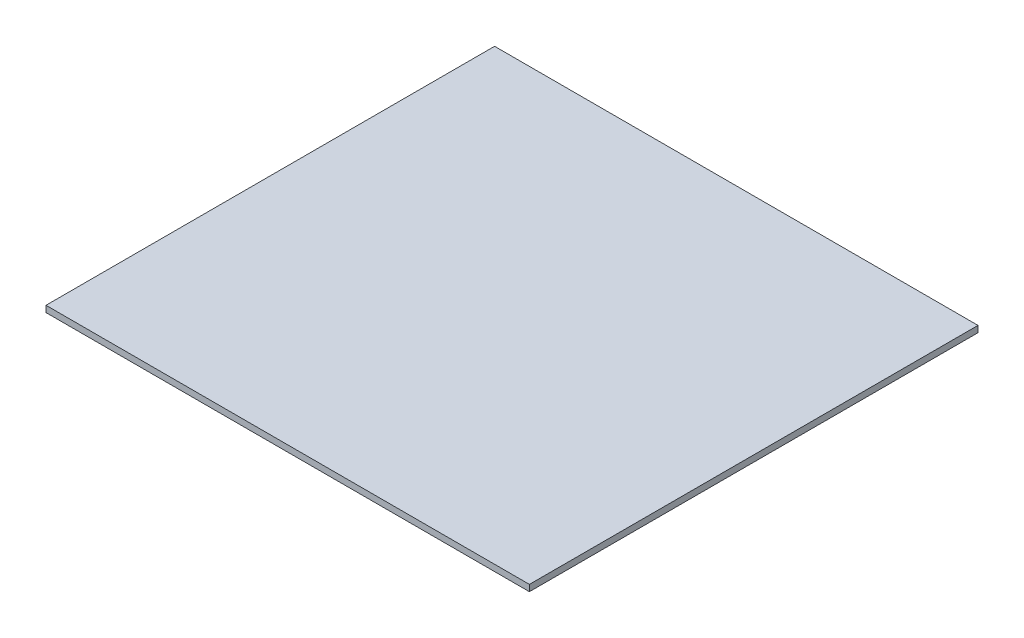
ISO-10303-21;
HEADER;
FILE_DESCRIPTION(('STEP AP214'),'2;1');
FILE_NAME('part.step','',(''),(''),'','','');
FILE_SCHEMA(('AUTOMOTIVE_DESIGN { 1 0 10303 214 1 1 1 1 }'));
ENDSEC;
DATA;
#1=APPLICATION_CONTEXT('core data for automotive mechanical design processes');
#2=APPLICATION_PROTOCOL_DEFINITION('international standard','automotive_design',2000,#1);
#3=PRODUCT_CONTEXT('',#1,'mechanical');
#4=PRODUCT('Part','Part','',(#3));
#5=PRODUCT_RELATED_PRODUCT_CATEGORY('part','',(#4));
#6=PRODUCT_DEFINITION_FORMATION('','',#4);
#7=PRODUCT_DEFINITION_CONTEXT('part definition',#1,'design');
#8=PRODUCT_DEFINITION('design','',#6,#7);
#9=PRODUCT_DEFINITION_SHAPE('','',#8);
#10=(LENGTH_UNIT() NAMED_UNIT(*) SI_UNIT(.MILLI.,.METRE.));
#11=(NAMED_UNIT(*) PLANE_ANGLE_UNIT() SI_UNIT($,.RADIAN.));
#12=(NAMED_UNIT(*) SI_UNIT($,.STERADIAN.) SOLID_ANGLE_UNIT());
#13=UNCERTAINTY_MEASURE_WITH_UNIT(LENGTH_MEASURE(1.E-05),#10,'distance_accuracy_value','');
#14=(GEOMETRIC_REPRESENTATION_CONTEXT(3) GLOBAL_UNCERTAINTY_ASSIGNED_CONTEXT((#13)) GLOBAL_UNIT_ASSIGNED_CONTEXT((#10,
#11,#12)) REPRESENTATION_CONTEXT('',''));
#15=CARTESIAN_POINT('',(0.,0.,0.));
#16=DIRECTION('',(0.,0.,1.));
#17=DIRECTION('',(1.,0.,0.));
#18=AXIS2_PLACEMENT_3D('',#15,#16,#17);
#19=CARTESIAN_POINT('',(0.,0.,-302.625));
#20=DIRECTION('',(0.,0.,1.));
#21=DIRECTION('',(1.,0.,0.));
#22=AXIS2_PLACEMENT_3D('',#19,#20,#21);
#23=PLANE('',#22);
#24=DIRECTION('',(-1.,0.,0.));
#25=VECTOR('',#24,1.);
#26=CARTESIAN_POINT('',(380.,14.9999999999999,-302.625));
#27=LINE('',#26,#25);
#28=CARTESIAN_POINT('',(225.,14.9999999999999,-302.625));
#29=VERTEX_POINT('',#28);
#30=CARTESIAN_POINT('',(-225.,15.,-302.625));
#31=VERTEX_POINT('',#30);
#32=EDGE_CURVE('E11',#29,#31,#27,.T.);
#33=ORIENTED_EDGE('',*,*,#32,.F.);
#34=DIRECTION('',(0.,-1.,0.));
#35=VECTOR('',#34,1.);
#36=CARTESIAN_POINT('',(225.,14.9999999999999,-302.625));
#37=LINE('',#36,#35);
#38=CARTESIAN_POINT('',(225.,0.,-302.625));
#39=VERTEX_POINT('',#38);
#40=EDGE_CURVE('E154',#29,#39,#37,.T.);
#41=ORIENTED_EDGE('',*,*,#40,.T.);
#42=DIRECTION('',(1.,0.,0.));
#43=VECTOR('',#42,1.);
#44=CARTESIAN_POINT('',(-225.,0.,-302.625));
#45=LINE('',#44,#43);
#46=CARTESIAN_POINT('',(-225.,0.,-302.625));
#47=VERTEX_POINT('',#46);
#48=EDGE_CURVE('E176',#47,#39,#45,.T.);
#49=ORIENTED_EDGE('',*,*,#48,.F.);
#50=DIRECTION('',(0.,-1.,0.));
#51=VECTOR('',#50,1.);
#52=CARTESIAN_POINT('',(-225.,15.,-302.625));
#53=LINE('',#52,#51);
#54=EDGE_CURVE('E172',#31,#47,#53,.T.);
#55=ORIENTED_EDGE('',*,*,#54,.F.);
#56=EDGE_LOOP('',(#33,#41,#49,#55));
#57=FACE_BOUND('',#56,.T.);
#58=ADVANCED_FACE('F39',(#57),#23,.F.);
#59=CARTESIAN_POINT('',(0.,25.,302.625));
#60=DIRECTION('',(0.,-1.,0.));
#61=DIRECTION('',(1.,0.,0.));
#62=AXIS2_PLACEMENT_3D('',#59,#60,#61);
#63=PLANE('',#62);
#64=DIRECTION('',(0.,0.,-1.));
#65=VECTOR('',#64,1.);
#66=CARTESIAN_POINT('',(380.,24.9999999999999,302.625));
#67=LINE('',#66,#65);
#68=CARTESIAN_POINT('',(380.,24.9999999999999,352.625));
#69=VERTEX_POINT('',#68);
#70=CARTESIAN_POINT('',(380.,24.9999999999999,-352.625));
#71=VERTEX_POINT('',#70);
#72=EDGE_CURVE('E118',#69,#71,#67,.T.);
#73=ORIENTED_EDGE('',*,*,#72,.T.);
#74=DIRECTION('',(1.,0.,0.));
#75=VECTOR('',#74,1.);
#76=CARTESIAN_POINT('',(380.,24.9999999999999,-352.625));
#77=LINE('',#76,#75);
#78=CARTESIAN_POINT('',(-380.,24.9999999999999,-352.625));
#79=VERTEX_POINT('',#78);
#80=EDGE_CURVE('E133',#79,#71,#77,.T.);
#81=ORIENTED_EDGE('',*,*,#80,.F.);
#82=DIRECTION('',(0.,0.,-1.));
#83=VECTOR('',#82,1.);
#84=CARTESIAN_POINT('',(-380.,25.,302.625));
#85=LINE('',#84,#83);
#86=CARTESIAN_POINT('',(-380.,25.,352.625));
#87=VERTEX_POINT('',#86);
#88=EDGE_CURVE('E43',#87,#79,#85,.T.);
#89=ORIENTED_EDGE('',*,*,#88,.F.);
#90=DIRECTION('',(-1.,0.,0.));
#91=VECTOR('',#90,1.);
#92=CARTESIAN_POINT('',(-380.,25.,352.625));
#93=LINE('',#92,#91);
#94=EDGE_CURVE('E150',#69,#87,#93,.T.);
#95=ORIENTED_EDGE('',*,*,#94,.F.);
#96=EDGE_LOOP('',(#73,#81,#89,#95));
#97=FACE_BOUND('',#96,.T.);
#98=ADVANCED_FACE('F41',(#97),#63,.F.);
#99=CARTESIAN_POINT('',(-380.,25.,302.625));
#100=DIRECTION('',(1.,0.,0.));
#101=DIRECTION('',(0.,0.,-1.));
#102=AXIS2_PLACEMENT_3D('',#99,#100,#101);
#103=PLANE('',#102);
#104=ORIENTED_EDGE('',*,*,#88,.T.);
#105=DIRECTION('',(0.,1.,0.));
#106=VECTOR('',#105,1.);
#107=CARTESIAN_POINT('',(-380.,24.9999999999999,-352.625));
#108=LINE('',#107,#106);
#109=CARTESIAN_POINT('',(-380.,14.9999999999999,-352.625));
#110=VERTEX_POINT('',#109);
#111=EDGE_CURVE('E128',#110,#79,#108,.T.);
#112=ORIENTED_EDGE('',*,*,#111,.F.);
#113=DIRECTION('',(0.,0.,-1.));
#114=VECTOR('',#113,1.);
#115=CARTESIAN_POINT('',(-380.,15.,302.625));
#116=LINE('',#115,#114);
#117=CARTESIAN_POINT('',(-380.,15.,352.625));
#118=VERTEX_POINT('',#117);
#119=EDGE_CURVE('E123',#118,#110,#116,.T.);
#120=ORIENTED_EDGE('',*,*,#119,.F.);
#121=DIRECTION('',(0.,-1.,0.));
#122=VECTOR('',#121,1.);
#123=CARTESIAN_POINT('',(-380.,25.,352.625));
#124=LINE('',#123,#122);
#125=EDGE_CURVE('E140',#87,#118,#124,.T.);
#126=ORIENTED_EDGE('',*,*,#125,.F.);
#127=EDGE_LOOP('',(#104,#112,#120,#126));
#128=FACE_BOUND('',#127,.T.);
#129=ADVANCED_FACE('F194',(#128),#103,.F.);
#130=CARTESIAN_POINT('',(-380.,15.,302.625));
#131=DIRECTION('',(0.,1.,0.));
#132=DIRECTION('',(-1.,0.,0.));
#133=AXIS2_PLACEMENT_3D('',#130,#131,#132);
#134=PLANE('',#133);
#135=DIRECTION('',(0.,0.,-1.));
#136=VECTOR('',#135,1.);
#137=CARTESIAN_POINT('',(225.,14.9999999999999,302.625));
#138=LINE('',#137,#136);
#139=CARTESIAN_POINT('',(225.,14.9999999999999,302.625));
#140=VERTEX_POINT('',#139);
#141=EDGE_CURVE('E117',#140,#29,#138,.T.);
#142=ORIENTED_EDGE('',*,*,#141,.T.);
#143=ORIENTED_EDGE('',*,*,#32,.T.);
#144=DIRECTION('',(0.,0.,-1.));
#145=VECTOR('',#144,1.);
#146=CARTESIAN_POINT('',(-225.,15.,302.625));
#147=LINE('',#146,#145);
#148=CARTESIAN_POINT('',(-225.,15.,302.625));
#149=VERTEX_POINT('',#148);
#150=EDGE_CURVE('E188',#149,#31,#147,.T.);
#151=ORIENTED_EDGE('',*,*,#150,.F.);
#152=DIRECTION('',(1.,0.,0.));
#153=VECTOR('',#152,1.);
#154=CARTESIAN_POINT('',(-380.,15.,302.625));
#155=LINE('',#154,#153);
#156=EDGE_CURVE('E50',#149,#140,#155,.T.);
#157=ORIENTED_EDGE('',*,*,#156,.T.);
#158=EDGE_LOOP('',(#142,#143,#151,#157));
#159=FACE_BOUND('',#158,.T.);
#160=ORIENTED_EDGE('',*,*,#119,.T.);
#161=DIRECTION('',(-1.,0.,0.));
#162=VECTOR('',#161,1.);
#163=CARTESIAN_POINT('',(380.,14.9999999999999,-352.625));
#164=LINE('',#163,#162);
#165=CARTESIAN_POINT('',(380.,14.9999999999999,-352.625));
#166=VERTEX_POINT('',#165);
#167=EDGE_CURVE('E121',#166,#110,#164,.T.);
#168=ORIENTED_EDGE('',*,*,#167,.F.);
#169=DIRECTION('',(0.,0.,-1.));
#170=VECTOR('',#169,1.);
#171=CARTESIAN_POINT('',(380.,14.9999999999999,302.625));
#172=LINE('',#171,#170);
#173=CARTESIAN_POINT('',(380.,15.,352.625));
#174=VERTEX_POINT('',#173);
#175=EDGE_CURVE('E106',#174,#166,#172,.T.);
#176=ORIENTED_EDGE('',*,*,#175,.F.);
#177=DIRECTION('',(1.,0.,0.));
#178=VECTOR('',#177,1.);
#179=CARTESIAN_POINT('',(-380.,15.,352.625));
#180=LINE('',#179,#178);
#181=EDGE_CURVE('E145',#118,#174,#180,.T.);
#182=ORIENTED_EDGE('',*,*,#181,.F.);
#183=EDGE_LOOP('',(#160,#168,#176,#182));
#184=FACE_BOUND('',#183,.T.);
#185=ADVANCED_FACE('F122',(#159,#184),#134,.F.);
#186=CARTESIAN_POINT('',(-225.,15.,302.625));
#187=DIRECTION('',(1.,0.,0.));
#188=DIRECTION('',(0.,0.,-1.));
#189=AXIS2_PLACEMENT_3D('',#186,#187,#188);
#190=PLANE('',#189);
#191=ORIENTED_EDGE('',*,*,#54,.T.);
#192=DIRECTION('',(0.,0.,-1.));
#193=VECTOR('',#192,1.);
#194=CARTESIAN_POINT('',(-225.,0.,302.625));
#195=LINE('',#194,#193);
#196=CARTESIAN_POINT('',(-225.,0.,302.625));
#197=VERTEX_POINT('',#196);
#198=EDGE_CURVE('E179',#197,#47,#195,.T.);
#199=ORIENTED_EDGE('',*,*,#198,.F.);
#200=DIRECTION('',(0.,-1.,0.));
#201=VECTOR('',#200,1.);
#202=CARTESIAN_POINT('',(-225.,15.,302.625));
#203=LINE('',#202,#201);
#204=EDGE_CURVE('E58',#149,#197,#203,.T.);
#205=ORIENTED_EDGE('',*,*,#204,.F.);
#206=ORIENTED_EDGE('',*,*,#150,.T.);
#207=EDGE_LOOP('',(#191,#199,#205,#206));
#208=FACE_BOUND('',#207,.T.);
#209=ADVANCED_FACE('F221',(#208),#190,.F.);
#210=CARTESIAN_POINT('',(-225.,0.,302.625));
#211=DIRECTION('',(0.,1.,0.));
#212=DIRECTION('',(0.,0.,1.));
#213=AXIS2_PLACEMENT_3D('',#210,#211,#212);
#214=PLANE('',#213);
#215=ORIENTED_EDGE('',*,*,#48,.T.);
#216=DIRECTION('',(0.,0.,-1.));
#217=VECTOR('',#216,1.);
#218=CARTESIAN_POINT('',(225.,0.,302.625));
#219=LINE('',#218,#217);
#220=CARTESIAN_POINT('',(225.,0.,302.625));
#221=VERTEX_POINT('',#220);
#222=EDGE_CURVE('E168',#221,#39,#219,.T.);
#223=ORIENTED_EDGE('',*,*,#222,.F.);
#224=DIRECTION('',(1.,0.,0.));
#225=VECTOR('',#224,1.);
#226=CARTESIAN_POINT('',(-225.,0.,302.625));
#227=LINE('',#226,#225);
#228=EDGE_CURVE('E175',#197,#221,#227,.T.);
#229=ORIENTED_EDGE('',*,*,#228,.F.);
#230=ORIENTED_EDGE('',*,*,#198,.T.);
#231=EDGE_LOOP('',(#215,#223,#229,#230));
#232=FACE_BOUND('',#231,.T.);
#233=ADVANCED_FACE('F218',(#232),#214,.F.);
#234=CARTESIAN_POINT('',(0.,0.,302.625));
#235=DIRECTION('',(0.,0.,1.));
#236=DIRECTION('',(1.,0.,0.));
#237=AXIS2_PLACEMENT_3D('',#234,#235,#236);
#238=PLANE('',#237);
#239=ORIENTED_EDGE('',*,*,#156,.F.);
#240=ORIENTED_EDGE('',*,*,#204,.T.);
#241=ORIENTED_EDGE('',*,*,#228,.T.);
#242=DIRECTION('',(0.,-1.,0.));
#243=VECTOR('',#242,1.);
#244=CARTESIAN_POINT('',(225.,14.9999999999999,302.625));
#245=LINE('',#244,#243);
#246=EDGE_CURVE('E157',#140,#221,#245,.T.);
#247=ORIENTED_EDGE('',*,*,#246,.F.);
#248=EDGE_LOOP('',(#239,#240,#241,#247));
#249=FACE_BOUND('',#248,.T.);
#250=ADVANCED_FACE('F216',(#249),#238,.T.);
#251=CARTESIAN_POINT('',(225.,14.9999999999999,302.625));
#252=DIRECTION('',(1.,0.,0.));
#253=DIRECTION('',(0.,1.,0.));
#254=AXIS2_PLACEMENT_3D('',#251,#252,#253);
#255=PLANE('',#254);
#256=ORIENTED_EDGE('',*,*,#40,.F.);
#257=ORIENTED_EDGE('',*,*,#141,.F.);
#258=ORIENTED_EDGE('',*,*,#246,.T.);
#259=ORIENTED_EDGE('',*,*,#222,.T.);
#260=EDGE_LOOP('',(#256,#257,#258,#259));
#261=FACE_BOUND('',#260,.T.);
#262=ADVANCED_FACE('F206',(#261),#255,.T.);
#263=CARTESIAN_POINT('',(380.,24.9999999999999,302.625));
#264=DIRECTION('',(1.,0.,0.));
#265=DIRECTION('',(0.,1.,0.));
#266=AXIS2_PLACEMENT_3D('',#263,#264,#265);
#267=PLANE('',#266);
#268=ORIENTED_EDGE('',*,*,#175,.T.);
#269=DIRECTION('',(0.,-1.,0.));
#270=VECTOR('',#269,1.);
#271=CARTESIAN_POINT('',(380.,24.9999999999999,-352.625));
#272=LINE('',#271,#270);
#273=EDGE_CURVE('E110',#71,#166,#272,.T.);
#274=ORIENTED_EDGE('',*,*,#273,.F.);
#275=ORIENTED_EDGE('',*,*,#72,.F.);
#276=DIRECTION('',(0.,1.,0.));
#277=VECTOR('',#276,1.);
#278=CARTESIAN_POINT('',(380.,24.9999999999999,352.625));
#279=LINE('',#278,#277);
#280=EDGE_CURVE('E112',#174,#69,#279,.T.);
#281=ORIENTED_EDGE('',*,*,#280,.F.);
#282=EDGE_LOOP('',(#268,#274,#275,#281));
#283=FACE_BOUND('',#282,.T.);
#284=ADVANCED_FACE('F108',(#283),#267,.T.);
#285=CARTESIAN_POINT('',(0.,0.,352.625));
#286=DIRECTION('',(0.,0.,1.));
#287=DIRECTION('',(1.,0.,0.));
#288=AXIS2_PLACEMENT_3D('',#285,#286,#287);
#289=PLANE('',#288);
#290=ORIENTED_EDGE('',*,*,#125,.T.);
#291=ORIENTED_EDGE('',*,*,#181,.T.);
#292=ORIENTED_EDGE('',*,*,#280,.T.);
#293=ORIENTED_EDGE('',*,*,#94,.T.);
#294=EDGE_LOOP('',(#290,#291,#292,#293));
#295=FACE_BOUND('',#294,.T.);
#296=ADVANCED_FACE('F198',(#295),#289,.T.);
#297=CARTESIAN_POINT('',(0.,0.,-352.625));
#298=DIRECTION('',(0.,0.,-1.));
#299=DIRECTION('',(-1.,0.,0.));
#300=AXIS2_PLACEMENT_3D('',#297,#298,#299);
#301=PLANE('',#300);
#302=ORIENTED_EDGE('',*,*,#273,.T.);
#303=ORIENTED_EDGE('',*,*,#167,.T.);
#304=ORIENTED_EDGE('',*,*,#111,.T.);
#305=ORIENTED_EDGE('',*,*,#80,.T.);
#306=EDGE_LOOP('',(#302,#303,#304,#305));
#307=FACE_BOUND('',#306,.T.);
#308=ADVANCED_FACE('F131',(#307),#301,.T.);
#309=CLOSED_SHELL('',(#58,#98,#129,#185,#209,#233,#250,#262,#284,#296,#308));
#310=MANIFOLD_SOLID_BREP('B2',#309);
#311=ADVANCED_BREP_SHAPE_REPRESENTATION('',(#18,#310),#14);
#312=SHAPE_DEFINITION_REPRESENTATION(#9,#311);
ENDSEC;
END-ISO-10303-21;
